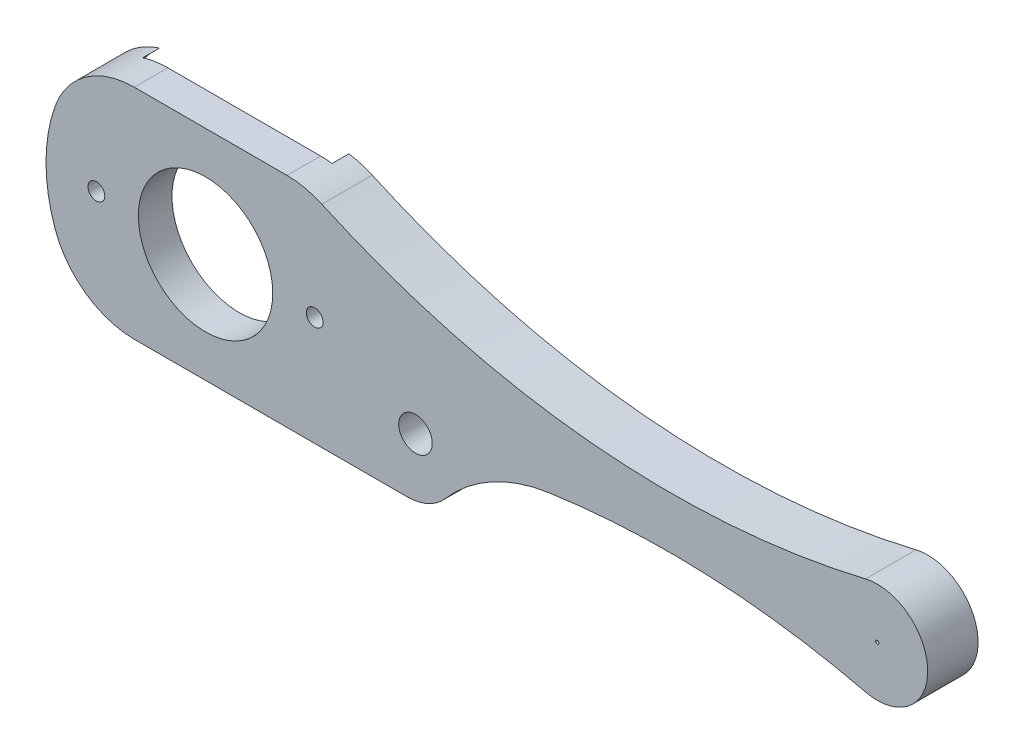
ISO-10303-21;
HEADER;
FILE_DESCRIPTION(('STEP AP214'),'2;1');
FILE_NAME('part.step','',(''),(''),'','','');
FILE_SCHEMA(('AUTOMOTIVE_DESIGN { 1 0 10303 214 1 1 1 1 }'));
ENDSEC;
DATA;
#1=APPLICATION_CONTEXT('core data for automotive mechanical design processes');
#2=APPLICATION_PROTOCOL_DEFINITION('international standard','automotive_design',2000,#1);
#3=PRODUCT_CONTEXT('',#1,'mechanical');
#4=PRODUCT('Part','Part','',(#3));
#5=PRODUCT_RELATED_PRODUCT_CATEGORY('part','',(#4));
#6=PRODUCT_DEFINITION_FORMATION('','',#4);
#7=PRODUCT_DEFINITION_CONTEXT('part definition',#1,'design');
#8=PRODUCT_DEFINITION('design','',#6,#7);
#9=PRODUCT_DEFINITION_SHAPE('','',#8);
#10=(LENGTH_UNIT() NAMED_UNIT(*) SI_UNIT(.MILLI.,.METRE.));
#11=(NAMED_UNIT(*) PLANE_ANGLE_UNIT() SI_UNIT($,.RADIAN.));
#12=(NAMED_UNIT(*) SI_UNIT($,.STERADIAN.) SOLID_ANGLE_UNIT());
#13=UNCERTAINTY_MEASURE_WITH_UNIT(LENGTH_MEASURE(1.E-05),#10,'distance_accuracy_value','');
#14=(GEOMETRIC_REPRESENTATION_CONTEXT(3) GLOBAL_UNCERTAINTY_ASSIGNED_CONTEXT((#13)) GLOBAL_UNIT_ASSIGNED_CONTEXT((#10,
#11,#12)) REPRESENTATION_CONTEXT('',''));
#15=CARTESIAN_POINT('',(0.,0.,0.));
#16=DIRECTION('',(0.,0.,1.));
#17=DIRECTION('',(1.,0.,0.));
#18=AXIS2_PLACEMENT_3D('',#15,#16,#17);
#19=CARTESIAN_POINT('',(-15.,-15.,0.));
#20=DIRECTION('',(0.,0.,1.));
#21=DIRECTION('',(1.,0.,0.));
#22=AXIS2_PLACEMENT_3D('',#19,#20,#21);
#23=PLANE('',#22);
#24=CARTESIAN_POINT('',(0.,0.,0.));
#25=DIRECTION('',(0.,0.,1.));
#26=DIRECTION('',(1.,0.,0.));
#27=AXIS2_PLACEMENT_3D('',#24,#25,#26);
#28=CIRCLE('',#27,9.5);
#29=CARTESIAN_POINT('',(-8.9566858950296,3.16666666666667,0.));
#30=VERTEX_POINT('',#29);
#31=CARTESIAN_POINT('',(-8.9566858950296,-3.16666666666667,0.));
#32=VERTEX_POINT('',#31);
#33=EDGE_CURVE('E337',#30,#32,#28,.T.);
#34=ORIENTED_EDGE('',*,*,#33,.F.);
#35=CARTESIAN_POINT('',(-4.24264068711928,1.5,0.));
#36=DIRECTION('',(0.,0.,1.));
#37=DIRECTION('',(1.,0.,0.));
#38=AXIS2_PLACEMENT_3D('',#35,#36,#37);
#39=CIRCLE('',#38,5.);
#40=CARTESIAN_POINT('',(-5.73773447853214,6.27123616632825,0.));
#41=VERTEX_POINT('',#40);
#42=EDGE_CURVE('E335',#41,#30,#39,.T.);
#43=ORIENTED_EDGE('',*,*,#42,.F.);
#44=CARTESIAN_POINT('',(0.,0.,0.));
#45=DIRECTION('',(0.,0.,1.));
#46=DIRECTION('',(1.,0.,0.));
#47=AXIS2_PLACEMENT_3D('',#44,#45,#46);
#48=CIRCLE('',#47,8.5);
#49=CARTESIAN_POINT('',(-5.73773447853214,-6.27123616632825,0.));
#50=VERTEX_POINT('',#49);
#51=EDGE_CURVE('E398',#41,#50,#48,.T.);
#52=ORIENTED_EDGE('',*,*,#51,.T.);
#53=CARTESIAN_POINT('',(-4.24264068711928,-1.5,0.));
#54=DIRECTION('',(0.,0.,1.));
#55=DIRECTION('',(-1.,0.,0.));
#56=AXIS2_PLACEMENT_3D('',#53,#54,#55);
#57=CIRCLE('',#56,5.);
#58=EDGE_CURVE('E340',#32,#50,#57,.T.);
#59=ORIENTED_EDGE('',*,*,#58,.F.);
#60=EDGE_LOOP('',(#34,#43,#52,#59));
#61=FACE_BOUND('',#60,.T.);
#62=ADVANCED_FACE('F34',(#61),#23,.F.);
#63=CARTESIAN_POINT('',(0.,0.,1.));
#64=DIRECTION('',(0.,0.,-1.));
#65=DIRECTION('',(-1.,0.,0.));
#66=AXIS2_PLACEMENT_3D('',#63,#64,#65);
#67=CYLINDRICAL_SURFACE('',#66,8.5);
#68=DIRECTION('',(0.,0.,-1.));
#69=VECTOR('',#68,1.);
#70=CARTESIAN_POINT('',(5.53211423569837,6.45334890449784,1.5));
#71=LINE('',#70,#69);
#72=CARTESIAN_POINT('',(5.53211423569837,6.45334890449784,0.));
#73=VERTEX_POINT('',#72);
#74=CARTESIAN_POINT('',(5.53211423569837,6.45334890449784,1.));
#75=VERTEX_POINT('',#74);
#76=EDGE_CURVE('E42',#73,#75,#71,.F.);
#77=ORIENTED_EDGE('',*,*,#76,.F.);
#78=CARTESIAN_POINT('',(5.47722557505166,-6.5,0.));
#79=VERTEX_POINT('',#78);
#80=EDGE_CURVE('E393',#79,#73,#48,.T.);
#81=ORIENTED_EDGE('',*,*,#80,.F.);
#82=DIRECTION('',(0.,0.,-1.));
#83=VECTOR('',#82,1.);
#84=CARTESIAN_POINT('',(5.47722557505166,-6.5,1.));
#85=LINE('',#84,#83);
#86=CARTESIAN_POINT('',(5.47722557505166,-6.5,1.));
#87=VERTEX_POINT('',#86);
#88=EDGE_CURVE('E429',#87,#79,#85,.T.);
#89=ORIENTED_EDGE('',*,*,#88,.F.);
#90=CARTESIAN_POINT('',(0.,0.,1.));
#91=DIRECTION('',(0.,0.,1.));
#92=DIRECTION('',(1.,0.,0.));
#93=AXIS2_PLACEMENT_3D('',#90,#91,#92);
#94=CIRCLE('',#93,8.5);
#95=EDGE_CURVE('E394',#87,#75,#94,.T.);
#96=ORIENTED_EDGE('',*,*,#95,.T.);
#97=EDGE_LOOP('',(#77,#81,#89,#96));
#98=FACE_BOUND('',#97,.T.);
#99=ADVANCED_FACE('F447',(#98),#67,.F.);
#100=CARTESIAN_POINT('',(15.3842180039987,-2.55797359602946,0.));
#101=DIRECTION('',(0.,0.,1.));
#102=DIRECTION('',(1.,0.,0.));
#103=AXIS2_PLACEMENT_3D('',#100,#101,#102);
#104=CIRCLE('',#103,0.625000000000002);
#105=CARTESIAN_POINT('',(14.7664310881251,-2.6526537236984,0.));
#106=VERTEX_POINT('',#105);
#107=CARTESIAN_POINT('',(15.7386882696293,-3.07273162732552,0.));
#108=VERTEX_POINT('',#107);
#109=EDGE_CURVE('E224',#106,#108,#104,.T.);
#110=ORIENTED_EDGE('',*,*,#109,.T.);
#111=CARTESIAN_POINT('',(21.8639344597254,-11.9677504081215,0.));
#112=DIRECTION('',(0.,0.,1.));
#113=DIRECTION('',(1.,0.,0.));
#114=AXIS2_PLACEMENT_3D('',#111,#112,#113);
#115=CIRCLE('',#114,10.8);
#116=CARTESIAN_POINT('',(20.2974780138513,-1.28195543520632,0.));
#117=VERTEX_POINT('',#116);
#118=EDGE_CURVE('E49',#117,#108,#115,.T.);
#119=ORIENTED_EDGE('',*,*,#118,.F.);
#120=CARTESIAN_POINT('',(27.665625,-51.5447688263259,0.));
#121=DIRECTION('',(0.,0.,1.));
#122=DIRECTION('',(1.,0.,0.));
#123=AXIS2_PLACEMENT_3D('',#120,#121,#122);
#124=CIRCLE('',#123,50.8);
#125=CARTESIAN_POINT('',(36.3766297245662,-1.49720748025643,0.));
#126=VERTEX_POINT('',#125);
#127=EDGE_CURVE('E214',#126,#117,#124,.T.);
#128=ORIENTED_EDGE('',*,*,#127,.F.);
#129=CARTESIAN_POINT('',(36.4838025189137,-0.881464845585303,0.));
#130=DIRECTION('',(0.,0.,1.));
#131=DIRECTION('',(1.,0.,0.));
#132=AXIS2_PLACEMENT_3D('',#129,#130,#131);
#133=CIRCLE('',#132,0.624999999999998);
#134=CARTESIAN_POINT('',(37.0900434639286,-0.729488148070595,0.));
#135=VERTEX_POINT('',#134);
#136=EDGE_CURVE('E254',#126,#135,#133,.T.);
#137=ORIENTED_EDGE('',*,*,#136,.T.);
#138=CARTESIAN_POINT('',(40.,0.,0.));
#139=DIRECTION('',(0.,0.,1.));
#140=DIRECTION('',(1.,0.,0.));
#141=AXIS2_PLACEMENT_3D('',#138,#139,#140);
#142=CIRCLE('',#141,3.00000000000001);
#143=CARTESIAN_POINT('',(37.0900434639286,0.729488148070596,0.));
#144=VERTEX_POINT('',#143);
#145=EDGE_CURVE('E257',#144,#135,#142,.T.);
#146=ORIENTED_EDGE('',*,*,#145,.F.);
#147=CARTESIAN_POINT('',(36.4838025189137,0.881464845585303,0.));
#148=DIRECTION('',(0.,0.,1.));
#149=DIRECTION('',(1.,0.,0.));
#150=AXIS2_PLACEMENT_3D('',#147,#148,#149);
#151=CIRCLE('',#150,0.624999999999998);
#152=CARTESIAN_POINT('',(36.3766297245662,1.49720748025643,0.));
#153=VERTEX_POINT('',#152);
#154=EDGE_CURVE('E260',#144,#153,#151,.T.);
#155=ORIENTED_EDGE('',*,*,#154,.T.);
#156=CARTESIAN_POINT('',(27.665625,51.5447688263259,0.));
#157=DIRECTION('',(0.,0.,1.));
#158=DIRECTION('',(1.,0.,0.));
#159=AXIS2_PLACEMENT_3D('',#156,#157,#158);
#160=CIRCLE('',#159,50.8);
#161=CARTESIAN_POINT('',(10.0492827611848,3.89705653995334,0.));
#162=VERTEX_POINT('',#161);
#163=EDGE_CURVE('E263',#162,#153,#160,.T.);
#164=ORIENTED_EDGE('',*,*,#163,.F.);
#165=CARTESIAN_POINT('',(9.83254626710492,3.3108396072962,0.));
#166=DIRECTION('',(0.,0.,1.));
#167=DIRECTION('',(1.,0.,0.));
#168=AXIS2_PLACEMENT_3D('',#165,#166,#167);
#169=CIRCLE('',#168,0.625);
#170=CARTESIAN_POINT('',(9.24022420282149,3.11139143818197,0.));
#171=VERTEX_POINT('',#170);
#172=EDGE_CURVE('E266',#162,#171,#169,.T.);
#173=ORIENTED_EDGE('',*,*,#172,.T.);
#174=CARTESIAN_POINT('',(0.,0.,0.));
#175=DIRECTION('',(0.,0.,1.));
#176=DIRECTION('',(1.,0.,0.));
#177=AXIS2_PLACEMENT_3D('',#174,#175,#176);
#178=CIRCLE('',#177,9.75);
#179=CARTESIAN_POINT('',(9.69901256334507,-0.995818907269018,0.));
#180=VERTEX_POINT('',#179);
#181=EDGE_CURVE('E269',#180,#171,#178,.T.);
#182=ORIENTED_EDGE('',*,*,#181,.F.);
#183=CARTESIAN_POINT('',(10.3207441379185,-1.05965345260677,0.));
#184=DIRECTION('',(0.,0.,1.));
#185=DIRECTION('',(1.,0.,0.));
#186=AXIS2_PLACEMENT_3D('',#183,#184,#185);
#187=CIRCLE('',#186,0.625);
#188=CARTESIAN_POINT('',(10.7875312379464,-1.4752672195197,0.));
#189=VERTEX_POINT('',#188);
#190=EDGE_CURVE('E272',#180,#189,#187,.T.);
#191=ORIENTED_EDGE('',*,*,#190,.T.);
#192=CARTESIAN_POINT('',(12.5,-3.,0.));
#193=DIRECTION('',(0.,0.,1.));
#194=DIRECTION('',(1.,0.,0.));
#195=AXIS2_PLACEMENT_3D('',#192,#193,#194);
#196=CIRCLE('',#195,2.29289321881345);
#197=EDGE_CURVE('E275',#106,#189,#196,.T.);
#198=ORIENTED_EDGE('',*,*,#197,.F.);
#199=EDGE_LOOP('',(#110,#119,#128,#137,#146,#155,#164,#173,#182,#191,#198));
#200=FACE_BOUND('',#199,.T.);
#201=ORIENTED_EDGE('',*,*,#80,.T.);
#202=CARTESIAN_POINT('',(4.85069319822591,1.5,0.));
#203=DIRECTION('',(0.,0.,1.));
#204=DIRECTION('',(1.,0.,0.));
#205=AXIS2_PLACEMENT_3D('',#202,#203,#204);
#206=CIRCLE('',#205,5.);
#207=CARTESIAN_POINT('',(6.9247779074781,6.0495244387569,0.));
#208=VERTEX_POINT('',#207);
#209=EDGE_CURVE('E333',#208,#73,#206,.T.);
#210=ORIENTED_EDGE('',*,*,#209,.F.);
#211=CARTESIAN_POINT('',(27.665625,51.5447688263259,0.));
#212=DIRECTION('',(0.,0.,-1.));
#213=DIRECTION('',(1.,0.,0.));
#214=AXIS2_PLACEMENT_3D('',#211,#212,#213);
#215=CIRCLE('',#214,50.);
#216=CARTESIAN_POINT('',(39.3018278301887,2.91762842413166,0.));
#217=VERTEX_POINT('',#216);
#218=EDGE_CURVE('E215',#217,#208,#215,.T.);
#219=ORIENTED_EDGE('',*,*,#218,.F.);
#220=CARTESIAN_POINT('',(40.,0.,0.));
#221=DIRECTION('',(0.,0.,1.));
#222=DIRECTION('',(1.,0.,0.));
#223=AXIS2_PLACEMENT_3D('',#220,#221,#222);
#224=CIRCLE('',#223,3.00000000000001);
#225=CARTESIAN_POINT('',(39.3018278301887,-2.91762842413166,0.));
#226=VERTEX_POINT('',#225);
#227=EDGE_CURVE('E300',#226,#217,#224,.T.);
#228=ORIENTED_EDGE('',*,*,#227,.F.);
#229=CARTESIAN_POINT('',(27.665625,-51.5447688263259,0.));
#230=DIRECTION('',(0.,0.,-1.));
#231=DIRECTION('',(-1.,0.,0.));
#232=AXIS2_PLACEMENT_3D('',#229,#230,#231);
#233=CIRCLE('',#232,50.);
#234=CARTESIAN_POINT('',(20.4135118246568,-2.0734958035704,0.));
#235=VERTEX_POINT('',#234);
#236=EDGE_CURVE('E350',#235,#226,#233,.T.);
#237=ORIENTED_EDGE('',*,*,#236,.F.);
#238=CARTESIAN_POINT('',(21.8639344597254,-11.9677504081215,0.));
#239=DIRECTION('',(0.,0.,-1.));
#240=DIRECTION('',(-1.,0.,0.));
#241=AXIS2_PLACEMENT_3D('',#238,#239,#240);
#242=CIRCLE('',#241,10.);
#243=CARTESIAN_POINT('',(14.2762925676289,-5.45409624802804,0.));
#244=VERTEX_POINT('',#243);
#245=EDGE_CURVE('E347',#244,#235,#242,.T.);
#246=ORIENTED_EDGE('',*,*,#245,.F.);
#247=CARTESIAN_POINT('',(12.,-3.5,0.));
#248=DIRECTION('',(0.,0.,1.));
#249=DIRECTION('',(1.,0.,0.));
#250=AXIS2_PLACEMENT_3D('',#247,#248,#249);
#251=CIRCLE('',#250,3.);
#252=CARTESIAN_POINT('',(12.,-6.5,0.));
#253=VERTEX_POINT('',#252);
#254=EDGE_CURVE('E344',#253,#244,#251,.T.);
#255=ORIENTED_EDGE('',*,*,#254,.F.);
#256=DIRECTION('',(1.,0.,0.));
#257=VECTOR('',#256,1.);
#258=CARTESIAN_POINT('',(-4.24264068711928,-6.5,0.));
#259=LINE('',#258,#257);
#260=EDGE_CURVE('E342',#79,#253,#259,.T.);
#261=ORIENTED_EDGE('',*,*,#260,.F.);
#262=EDGE_LOOP('',(#201,#210,#219,#228,#237,#246,#255,#261));
#263=FACE_BOUND('',#262,.T.);
#264=CARTESIAN_POINT('',(40.,0.,0.));
#265=DIRECTION('',(0.,0.,1.));
#266=DIRECTION('',(1.,0.,0.));
#267=AXIS2_PLACEMENT_3D('',#264,#265,#266);
#268=CIRCLE('',#267,0.100000000000001);
#269=CARTESIAN_POINT('',(40.1,0.,0.));
#270=VERTEX_POINT('',#269);
#271=EDGE_CURVE('E420',#270,#270,#268,.T.);
#272=ORIENTED_EDGE('',*,*,#271,.T.);
#273=EDGE_LOOP('',(#272));
#274=FACE_BOUND('',#273,.T.);
#275=CARTESIAN_POINT('',(12.5,-3.,0.));
#276=DIRECTION('',(0.,0.,-1.));
#277=DIRECTION('',(-1.,0.,0.));
#278=AXIS2_PLACEMENT_3D('',#275,#276,#277);
#279=CIRCLE('',#278,0.999999999999999);
#280=CARTESIAN_POINT('',(11.5,-3.,0.));
#281=VERTEX_POINT('',#280);
#282=EDGE_CURVE('E411',#281,#281,#279,.T.);
#283=ORIENTED_EDGE('',*,*,#282,.F.);
#284=EDGE_LOOP('',(#283));
#285=FACE_BOUND('',#284,.T.);
#286=ADVANCED_FACE('F36',(#200,#263,#274,#285),#23,.F.);
#287=CARTESIAN_POINT('',(-15.,-15.,3.));
#288=DIRECTION('',(0.,0.,1.));
#289=DIRECTION('',(1.,0.,0.));
#290=AXIS2_PLACEMENT_3D('',#287,#288,#289);
#291=PLANE('',#290);
#292=CARTESIAN_POINT('',(27.665625,51.5447688263259,3.));
#293=DIRECTION('',(0.,0.,-1.));
#294=DIRECTION('',(1.,0.,0.));
#295=AXIS2_PLACEMENT_3D('',#292,#293,#294);
#296=CIRCLE('',#295,50.);
#297=CARTESIAN_POINT('',(39.3018278301887,2.91762842413166,3.));
#298=VERTEX_POINT('',#297);
#299=CARTESIAN_POINT('',(6.9247779074781,6.0495244387569,3.));
#300=VERTEX_POINT('',#299);
#301=EDGE_CURVE('E57',#298,#300,#296,.T.);
#302=ORIENTED_EDGE('',*,*,#301,.T.);
#303=CARTESIAN_POINT('',(4.85069319822591,1.5,3.));
#304=DIRECTION('',(0.,0.,1.));
#305=DIRECTION('',(1.,0.,0.));
#306=AXIS2_PLACEMENT_3D('',#303,#304,#305);
#307=CIRCLE('',#306,5.);
#308=CARTESIAN_POINT('',(4.85069319822591,6.5,3.));
#309=VERTEX_POINT('',#308);
#310=EDGE_CURVE('E299',#300,#309,#307,.T.);
#311=ORIENTED_EDGE('',*,*,#310,.T.);
#312=DIRECTION('',(-1.,0.,0.));
#313=VECTOR('',#312,1.);
#314=CARTESIAN_POINT('',(-4.24264068711928,6.5,3.));
#315=LINE('',#314,#313);
#316=CARTESIAN_POINT('',(-4.24264068711928,6.5,3.));
#317=VERTEX_POINT('',#316);
#318=EDGE_CURVE('E303',#309,#317,#315,.T.);
#319=ORIENTED_EDGE('',*,*,#318,.T.);
#320=CARTESIAN_POINT('',(-4.24264068711928,1.5,3.));
#321=DIRECTION('',(0.,0.,1.));
#322=DIRECTION('',(1.,0.,0.));
#323=AXIS2_PLACEMENT_3D('',#320,#321,#322);
#324=CIRCLE('',#323,5.);
#325=CARTESIAN_POINT('',(-8.9566858950296,3.16666666666667,3.));
#326=VERTEX_POINT('',#325);
#327=EDGE_CURVE('E306',#317,#326,#324,.T.);
#328=ORIENTED_EDGE('',*,*,#327,.T.);
#329=CARTESIAN_POINT('',(0.,0.,3.));
#330=DIRECTION('',(0.,0.,1.));
#331=DIRECTION('',(1.,0.,0.));
#332=AXIS2_PLACEMENT_3D('',#329,#330,#331);
#333=CIRCLE('',#332,9.5);
#334=CARTESIAN_POINT('',(-8.9566858950296,-3.16666666666667,3.));
#335=VERTEX_POINT('',#334);
#336=EDGE_CURVE('E309',#326,#335,#333,.T.);
#337=ORIENTED_EDGE('',*,*,#336,.T.);
#338=CARTESIAN_POINT('',(-4.24264068711928,-1.5,3.));
#339=DIRECTION('',(0.,0.,1.));
#340=DIRECTION('',(-1.,0.,0.));
#341=AXIS2_PLACEMENT_3D('',#338,#339,#340);
#342=CIRCLE('',#341,5.);
#343=CARTESIAN_POINT('',(-4.24264068711928,-6.5,3.));
#344=VERTEX_POINT('',#343);
#345=EDGE_CURVE('E312',#335,#344,#342,.T.);
#346=ORIENTED_EDGE('',*,*,#345,.T.);
#347=DIRECTION('',(1.,0.,0.));
#348=VECTOR('',#347,1.);
#349=CARTESIAN_POINT('',(-4.24264068711928,-6.5,3.));
#350=LINE('',#349,#348);
#351=CARTESIAN_POINT('',(12.,-6.5,3.));
#352=VERTEX_POINT('',#351);
#353=EDGE_CURVE('E315',#344,#352,#350,.T.);
#354=ORIENTED_EDGE('',*,*,#353,.T.);
#355=CARTESIAN_POINT('',(12.,-3.5,3.));
#356=DIRECTION('',(0.,0.,1.));
#357=DIRECTION('',(1.,0.,0.));
#358=AXIS2_PLACEMENT_3D('',#355,#356,#357);
#359=CIRCLE('',#358,3.);
#360=CARTESIAN_POINT('',(14.2762925676289,-5.45409624802804,3.));
#361=VERTEX_POINT('',#360);
#362=EDGE_CURVE('E318',#352,#361,#359,.T.);
#363=ORIENTED_EDGE('',*,*,#362,.T.);
#364=CARTESIAN_POINT('',(21.8639344597254,-11.9677504081215,3.));
#365=DIRECTION('',(0.,0.,-1.));
#366=DIRECTION('',(-1.,0.,0.));
#367=AXIS2_PLACEMENT_3D('',#364,#365,#366);
#368=CIRCLE('',#367,10.);
#369=CARTESIAN_POINT('',(20.4135118246568,-2.0734958035704,3.));
#370=VERTEX_POINT('',#369);
#371=EDGE_CURVE('E321',#361,#370,#368,.T.);
#372=ORIENTED_EDGE('',*,*,#371,.T.);
#373=CARTESIAN_POINT('',(27.665625,-51.5447688263259,3.));
#374=DIRECTION('',(0.,0.,-1.));
#375=DIRECTION('',(-1.,0.,0.));
#376=AXIS2_PLACEMENT_3D('',#373,#374,#375);
#377=CIRCLE('',#376,50.);
#378=CARTESIAN_POINT('',(39.3018278301887,-2.91762842413166,3.));
#379=VERTEX_POINT('',#378);
#380=EDGE_CURVE('E324',#370,#379,#377,.T.);
#381=ORIENTED_EDGE('',*,*,#380,.T.);
#382=CARTESIAN_POINT('',(40.,0.,3.));
#383=DIRECTION('',(0.,0.,1.));
#384=DIRECTION('',(1.,0.,0.));
#385=AXIS2_PLACEMENT_3D('',#382,#383,#384);
#386=CIRCLE('',#385,3.00000000000001);
#387=EDGE_CURVE('E327',#379,#298,#386,.T.);
#388=ORIENTED_EDGE('',*,*,#387,.T.);
#389=EDGE_LOOP('',(#302,#311,#319,#328,#337,#346,#354,#363,#372,#381,#388));
#390=FACE_BOUND('',#389,.T.);
#391=CARTESIAN_POINT('',(12.5,-3.,3.));
#392=DIRECTION('',(0.,0.,-1.));
#393=DIRECTION('',(-1.,0.,0.));
#394=AXIS2_PLACEMENT_3D('',#391,#392,#393);
#395=CIRCLE('',#394,0.999999999999999);
#396=CARTESIAN_POINT('',(11.5,-3.,3.));
#397=VERTEX_POINT('',#396);
#398=EDGE_CURVE('E408',#397,#397,#395,.T.);
#399=ORIENTED_EDGE('',*,*,#398,.T.);
#400=EDGE_LOOP('',(#399));
#401=FACE_BOUND('',#400,.T.);
#402=CARTESIAN_POINT('',(-6.5,0.,3.));
#403=DIRECTION('',(0.,0.,-1.));
#404=DIRECTION('',(-1.,0.,0.));
#405=AXIS2_PLACEMENT_3D('',#402,#403,#404);
#406=CIRCLE('',#405,0.499999999999999);
#407=CARTESIAN_POINT('',(-7.,0.,3.));
#408=VERTEX_POINT('',#407);
#409=EDGE_CURVE('E414',#408,#408,#406,.T.);
#410=ORIENTED_EDGE('',*,*,#409,.T.);
#411=EDGE_LOOP('',(#410));
#412=FACE_BOUND('',#411,.T.);
#413=CARTESIAN_POINT('',(6.5,0.,3.));
#414=DIRECTION('',(0.,0.,-1.));
#415=DIRECTION('',(-1.,0.,0.));
#416=AXIS2_PLACEMENT_3D('',#413,#414,#415);
#417=CIRCLE('',#416,0.499999999999999);
#418=CARTESIAN_POINT('',(6.,0.,3.));
#419=VERTEX_POINT('',#418);
#420=EDGE_CURVE('E417',#419,#419,#417,.T.);
#421=ORIENTED_EDGE('',*,*,#420,.T.);
#422=EDGE_LOOP('',(#421));
#423=FACE_BOUND('',#422,.T.);
#424=CARTESIAN_POINT('',(0.,0.,3.));
#425=DIRECTION('',(0.,0.,1.));
#426=DIRECTION('',(1.,0.,0.));
#427=AXIS2_PLACEMENT_3D('',#424,#425,#426);
#428=CIRCLE('',#427,4.);
#429=CARTESIAN_POINT('',(4.,0.,3.));
#430=VERTEX_POINT('',#429);
#431=EDGE_CURVE('E424',#430,#430,#428,.T.);
#432=ORIENTED_EDGE('',*,*,#431,.F.);
#433=EDGE_LOOP('',(#432));
#434=FACE_BOUND('',#433,.T.);
#435=CARTESIAN_POINT('',(40.,0.,3.));
#436=DIRECTION('',(0.,0.,1.));
#437=DIRECTION('',(1.,0.,0.));
#438=AXIS2_PLACEMENT_3D('',#435,#436,#437);
#439=CIRCLE('',#438,0.100000000000001);
#440=CARTESIAN_POINT('',(40.1,0.,3.));
#441=VERTEX_POINT('',#440);
#442=EDGE_CURVE('E421',#441,#441,#439,.T.);
#443=ORIENTED_EDGE('',*,*,#442,.F.);
#444=EDGE_LOOP('',(#443));
#445=FACE_BOUND('',#444,.T.);
#446=ADVANCED_FACE('F463',(#390,#401,#412,#423,#434,#445),#291,.T.);
#447=CARTESIAN_POINT('',(0.,0.,3.));
#448=DIRECTION('',(0.,0.,-1.));
#449=DIRECTION('',(-1.,0.,0.));
#450=AXIS2_PLACEMENT_3D('',#447,#448,#449);
#451=CYLINDRICAL_SURFACE('',#450,4.);
#452=CARTESIAN_POINT('',(0.,0.,1.));
#453=DIRECTION('',(0.,0.,1.));
#454=DIRECTION('',(1.,0.,0.));
#455=AXIS2_PLACEMENT_3D('',#452,#453,#454);
#456=CIRCLE('',#455,4.);
#457=CARTESIAN_POINT('',(4.,0.,1.));
#458=VERTEX_POINT('',#457);
#459=EDGE_CURVE('E404',#458,#458,#456,.T.);
#460=ORIENTED_EDGE('',*,*,#459,.F.);
#461=EDGE_LOOP('',(#460));
#462=FACE_BOUND('',#461,.T.);
#463=ORIENTED_EDGE('',*,*,#431,.T.);
#464=EDGE_LOOP('',(#463));
#465=FACE_BOUND('',#464,.T.);
#466=ADVANCED_FACE('F518',(#462,#465),#451,.F.);
#467=CARTESIAN_POINT('',(40.,0.,3.));
#468=DIRECTION('',(0.,0.,-1.));
#469=DIRECTION('',(-1.,0.,0.));
#470=AXIS2_PLACEMENT_3D('',#467,#468,#469);
#471=CYLINDRICAL_SURFACE('',#470,0.100000000000001);
#472=ORIENTED_EDGE('',*,*,#442,.T.);
#473=EDGE_LOOP('',(#472));
#474=FACE_BOUND('',#473,.T.);
#475=ORIENTED_EDGE('',*,*,#271,.F.);
#476=EDGE_LOOP('',(#475));
#477=FACE_BOUND('',#476,.T.);
#478=ADVANCED_FACE('F780',(#474,#477),#471,.F.);
#479=CARTESIAN_POINT('',(6.5,0.,0.));
#480=DIRECTION('',(0.,0.,-1.));
#481=DIRECTION('',(-1.,0.,0.));
#482=AXIS2_PLACEMENT_3D('',#479,#480,#481);
#483=CYLINDRICAL_SURFACE('',#482,0.499999999999999);
#484=CARTESIAN_POINT('',(6.5,0.,1.));
#485=DIRECTION('',(0.,0.,1.));
#486=DIRECTION('',(1.,0.,0.));
#487=AXIS2_PLACEMENT_3D('',#484,#485,#486);
#488=CIRCLE('',#487,0.499999999999999);
#489=CARTESIAN_POINT('',(7.,0.,1.));
#490=VERTEX_POINT('',#489);
#491=EDGE_CURVE('E401',#490,#490,#488,.F.);
#492=ORIENTED_EDGE('',*,*,#491,.T.);
#493=EDGE_LOOP('',(#492));
#494=FACE_BOUND('',#493,.T.);
#495=ORIENTED_EDGE('',*,*,#420,.F.);
#496=EDGE_LOOP('',(#495));
#497=FACE_BOUND('',#496,.T.);
#498=ADVANCED_FACE('F771',(#494,#497),#483,.F.);
#499=CARTESIAN_POINT('',(-6.5,0.,0.));
#500=DIRECTION('',(0.,0.,-1.));
#501=DIRECTION('',(-1.,0.,0.));
#502=AXIS2_PLACEMENT_3D('',#499,#500,#501);
#503=CYLINDRICAL_SURFACE('',#502,0.499999999999999);
#504=CARTESIAN_POINT('',(-6.5,0.,1.));
#505=DIRECTION('',(0.,0.,1.));
#506=DIRECTION('',(1.,0.,0.));
#507=AXIS2_PLACEMENT_3D('',#504,#505,#506);
#508=CIRCLE('',#507,0.499999999999999);
#509=CARTESIAN_POINT('',(-6.,0.,1.));
#510=VERTEX_POINT('',#509);
#511=EDGE_CURVE('E405',#510,#510,#508,.F.);
#512=ORIENTED_EDGE('',*,*,#511,.T.);
#513=EDGE_LOOP('',(#512));
#514=FACE_BOUND('',#513,.T.);
#515=ORIENTED_EDGE('',*,*,#409,.F.);
#516=EDGE_LOOP('',(#515));
#517=FACE_BOUND('',#516,.T.);
#518=ADVANCED_FACE('F761',(#514,#517),#503,.F.);
#519=CARTESIAN_POINT('',(12.5,-3.,0.));
#520=DIRECTION('',(0.,0.,-1.));
#521=DIRECTION('',(-1.,0.,0.));
#522=AXIS2_PLACEMENT_3D('',#519,#520,#521);
#523=CYLINDRICAL_SURFACE('',#522,0.999999999999999);
#524=ORIENTED_EDGE('',*,*,#398,.F.);
#525=EDGE_LOOP('',(#524));
#526=FACE_BOUND('',#525,.T.);
#527=ORIENTED_EDGE('',*,*,#282,.T.);
#528=EDGE_LOOP('',(#527));
#529=FACE_BOUND('',#528,.T.);
#530=ADVANCED_FACE('F748',(#526,#529),#523,.F.);
#531=CARTESIAN_POINT('',(0.,0.,1.));
#532=DIRECTION('',(0.,0.,1.));
#533=DIRECTION('',(1.,0.,0.));
#534=AXIS2_PLACEMENT_3D('',#531,#532,#533);
#535=PLANE('',#534);
#536=ORIENTED_EDGE('',*,*,#459,.T.);
#537=EDGE_LOOP('',(#536));
#538=FACE_BOUND('',#537,.T.);
#539=ORIENTED_EDGE('',*,*,#511,.F.);
#540=EDGE_LOOP('',(#539));
#541=FACE_BOUND('',#540,.T.);
#542=DIRECTION('',(1.,0.,0.));
#543=VECTOR('',#542,1.);
#544=CARTESIAN_POINT('',(0.,6.5,1.));
#545=LINE('',#544,#543);
#546=CARTESIAN_POINT('',(-4.24264068711928,6.5,1.));
#547=VERTEX_POINT('',#546);
#548=CARTESIAN_POINT('',(4.85069319822591,6.5,1.));
#549=VERTEX_POINT('',#548);
#550=EDGE_CURVE('E12',#547,#549,#545,.T.);
#551=ORIENTED_EDGE('',*,*,#550,.T.);
#552=CARTESIAN_POINT('',(4.85069319822591,1.5,1.));
#553=DIRECTION('',(0.,0.,1.));
#554=DIRECTION('',(1.,0.,0.));
#555=AXIS2_PLACEMENT_3D('',#552,#553,#554);
#556=CIRCLE('',#555,5.);
#557=EDGE_CURVE('E390',#549,#75,#556,.F.);
#558=ORIENTED_EDGE('',*,*,#557,.T.);
#559=ORIENTED_EDGE('',*,*,#95,.F.);
#560=DIRECTION('',(-1.,0.,0.));
#561=VECTOR('',#560,1.);
#562=CARTESIAN_POINT('',(0.,-6.5,1.));
#563=LINE('',#562,#561);
#564=CARTESIAN_POINT('',(-4.24264068711928,-6.5,1.));
#565=VERTEX_POINT('',#564);
#566=EDGE_CURVE('E381',#87,#565,#563,.T.);
#567=ORIENTED_EDGE('',*,*,#566,.T.);
#568=CARTESIAN_POINT('',(-4.24264068711928,-1.5,1.));
#569=DIRECTION('',(0.,0.,1.));
#570=DIRECTION('',(1.,0.,0.));
#571=AXIS2_PLACEMENT_3D('',#568,#569,#570);
#572=CIRCLE('',#571,5.);
#573=CARTESIAN_POINT('',(-5.73773447853214,-6.27123616632826,1.));
#574=VERTEX_POINT('',#573);
#575=EDGE_CURVE('E384',#565,#574,#572,.F.);
#576=ORIENTED_EDGE('',*,*,#575,.T.);
#577=CARTESIAN_POINT('',(-5.73773447853214,6.27123616632825,1.));
#578=VERTEX_POINT('',#577);
#579=EDGE_CURVE('E397',#578,#574,#94,.T.);
#580=ORIENTED_EDGE('',*,*,#579,.F.);
#581=CARTESIAN_POINT('',(-4.24264068711928,1.5,1.));
#582=DIRECTION('',(0.,0.,1.));
#583=DIRECTION('',(1.,0.,0.));
#584=AXIS2_PLACEMENT_3D('',#581,#582,#583);
#585=CIRCLE('',#584,5.);
#586=EDGE_CURVE('E387',#578,#547,#585,.F.);
#587=ORIENTED_EDGE('',*,*,#586,.T.);
#588=EDGE_LOOP('',(#551,#558,#559,#567,#576,#580,#587));
#589=FACE_BOUND('',#588,.T.);
#590=ORIENTED_EDGE('',*,*,#491,.F.);
#591=EDGE_LOOP('',(#590));
#592=FACE_BOUND('',#591,.T.);
#593=ADVANCED_FACE('F444',(#538,#541,#589,#592),#535,.F.);
#594=DIRECTION('',(0.,0.,-1.));
#595=VECTOR('',#594,1.);
#596=CARTESIAN_POINT('',(-5.73773447853215,6.27123616632825,1.5));
#597=LINE('',#596,#595);
#598=EDGE_CURVE('E435',#578,#41,#597,.T.);
#599=ORIENTED_EDGE('',*,*,#598,.F.);
#600=ORIENTED_EDGE('',*,*,#579,.T.);
#601=DIRECTION('',(0.,0.,-1.));
#602=VECTOR('',#601,1.);
#603=CARTESIAN_POINT('',(-5.73773447853215,-6.27123616632825,1.5));
#604=LINE('',#603,#602);
#605=EDGE_CURVE('E433',#50,#574,#604,.F.);
#606=ORIENTED_EDGE('',*,*,#605,.F.);
#607=ORIENTED_EDGE('',*,*,#51,.F.);
#608=EDGE_LOOP('',(#599,#600,#606,#607));
#609=FACE_BOUND('',#608,.T.);
#610=ADVANCED_FACE('F473',(#609),#67,.F.);
#611=CARTESIAN_POINT('',(-4.24264068711928,6.5,3.));
#612=DIRECTION('',(0.,-1.,0.));
#613=DIRECTION('',(1.,0.,0.));
#614=AXIS2_PLACEMENT_3D('',#611,#612,#613);
#615=PLANE('',#614);
#616=DIRECTION('',(0.,0.,-1.));
#617=VECTOR('',#616,1.);
#618=CARTESIAN_POINT('',(-4.24264068711928,6.5,3.));
#619=LINE('',#618,#617);
#620=EDGE_CURVE('E373',#317,#547,#619,.T.);
#621=ORIENTED_EDGE('',*,*,#620,.F.);
#622=ORIENTED_EDGE('',*,*,#318,.F.);
#623=DIRECTION('',(0.,0.,-1.));
#624=VECTOR('',#623,1.);
#625=CARTESIAN_POINT('',(4.85069319822591,6.5,3.));
#626=LINE('',#625,#624);
#627=EDGE_CURVE('E376',#309,#549,#626,.T.);
#628=ORIENTED_EDGE('',*,*,#627,.T.);
#629=ORIENTED_EDGE('',*,*,#550,.F.);
#630=EDGE_LOOP('',(#621,#622,#628,#629));
#631=FACE_BOUND('',#630,.T.);
#632=ADVANCED_FACE('F488',(#631),#615,.F.);
#633=CARTESIAN_POINT('',(4.85069319822591,1.5,3.));
#634=DIRECTION('',(0.,0.,-1.));
#635=DIRECTION('',(-1.,0.,0.));
#636=AXIS2_PLACEMENT_3D('',#633,#634,#635);
#637=CYLINDRICAL_SURFACE('',#636,5.);
#638=ORIENTED_EDGE('',*,*,#627,.F.);
#639=ORIENTED_EDGE('',*,*,#310,.F.);
#640=DIRECTION('',(0.,0.,-1.));
#641=VECTOR('',#640,1.);
#642=CARTESIAN_POINT('',(6.9247779074781,6.0495244387569,3.));
#643=LINE('',#642,#641);
#644=EDGE_CURVE('E379',#300,#208,#643,.T.);
#645=ORIENTED_EDGE('',*,*,#644,.T.);
#646=ORIENTED_EDGE('',*,*,#209,.T.);
#647=ORIENTED_EDGE('',*,*,#76,.T.);
#648=ORIENTED_EDGE('',*,*,#557,.F.);
#649=EDGE_LOOP('',(#638,#639,#645,#646,#647,#648));
#650=FACE_BOUND('',#649,.T.);
#651=ADVANCED_FACE('F438',(#650),#637,.T.);
#652=CARTESIAN_POINT('',(-4.24264068711928,1.5,3.));
#653=DIRECTION('',(0.,0.,-1.));
#654=DIRECTION('',(-1.,0.,0.));
#655=AXIS2_PLACEMENT_3D('',#652,#653,#654);
#656=CYLINDRICAL_SURFACE('',#655,5.);
#657=ORIENTED_EDGE('',*,*,#598,.T.);
#658=ORIENTED_EDGE('',*,*,#42,.T.);
#659=DIRECTION('',(0.,0.,-1.));
#660=VECTOR('',#659,1.);
#661=CARTESIAN_POINT('',(-8.9566858950296,3.16666666666667,3.));
#662=LINE('',#661,#660);
#663=EDGE_CURVE('E370',#326,#30,#662,.T.);
#664=ORIENTED_EDGE('',*,*,#663,.F.);
#665=ORIENTED_EDGE('',*,*,#327,.F.);
#666=ORIENTED_EDGE('',*,*,#620,.T.);
#667=ORIENTED_EDGE('',*,*,#586,.F.);
#668=EDGE_LOOP('',(#657,#658,#664,#665,#666,#667));
#669=FACE_BOUND('',#668,.T.);
#670=ADVANCED_FACE('F478',(#669),#656,.T.);
#671=CARTESIAN_POINT('',(-4.24264068711928,-1.5,3.));
#672=DIRECTION('',(0.,0.,-1.));
#673=DIRECTION('',(-1.,0.,0.));
#674=AXIS2_PLACEMENT_3D('',#671,#672,#673);
#675=CYLINDRICAL_SURFACE('',#674,5.);
#676=DIRECTION('',(0.,0.,-1.));
#677=VECTOR('',#676,1.);
#678=CARTESIAN_POINT('',(-4.24264068711928,-6.5,3.));
#679=LINE('',#678,#677);
#680=EDGE_CURVE('E365',#344,#565,#679,.T.);
#681=ORIENTED_EDGE('',*,*,#680,.F.);
#682=ORIENTED_EDGE('',*,*,#345,.F.);
#683=DIRECTION('',(0.,0.,-1.));
#684=VECTOR('',#683,1.);
#685=CARTESIAN_POINT('',(-8.9566858950296,-3.16666666666667,3.));
#686=LINE('',#685,#684);
#687=EDGE_CURVE('E368',#335,#32,#686,.T.);
#688=ORIENTED_EDGE('',*,*,#687,.T.);
#689=ORIENTED_EDGE('',*,*,#58,.T.);
#690=ORIENTED_EDGE('',*,*,#605,.T.);
#691=ORIENTED_EDGE('',*,*,#575,.F.);
#692=EDGE_LOOP('',(#681,#682,#688,#689,#690,#691));
#693=FACE_BOUND('',#692,.T.);
#694=ADVANCED_FACE('F467',(#693),#675,.T.);
#695=CARTESIAN_POINT('',(-4.24264068711928,-6.5,3.));
#696=DIRECTION('',(0.,1.,0.));
#697=DIRECTION('',(0.,0.,1.));
#698=AXIS2_PLACEMENT_3D('',#695,#696,#697);
#699=PLANE('',#698);
#700=ORIENTED_EDGE('',*,*,#88,.T.);
#701=ORIENTED_EDGE('',*,*,#260,.T.);
#702=DIRECTION('',(0.,0.,-1.));
#703=VECTOR('',#702,1.);
#704=CARTESIAN_POINT('',(12.,-6.5,3.));
#705=LINE('',#704,#703);
#706=EDGE_CURVE('E362',#352,#253,#705,.T.);
#707=ORIENTED_EDGE('',*,*,#706,.F.);
#708=ORIENTED_EDGE('',*,*,#353,.F.);
#709=ORIENTED_EDGE('',*,*,#680,.T.);
#710=ORIENTED_EDGE('',*,*,#566,.F.);
#711=EDGE_LOOP('',(#700,#701,#707,#708,#709,#710));
#712=FACE_BOUND('',#711,.T.);
#713=ADVANCED_FACE('F450',(#712),#699,.F.);
#714=CARTESIAN_POINT('',(27.665625,51.5447688263259,3.));
#715=DIRECTION('',(0.,0.,-1.));
#716=DIRECTION('',(-1.,0.,0.));
#717=AXIS2_PLACEMENT_3D('',#714,#715,#716);
#718=CYLINDRICAL_SURFACE('',#717,50.);
#719=ORIENTED_EDGE('',*,*,#218,.T.);
#720=ORIENTED_EDGE('',*,*,#644,.F.);
#721=ORIENTED_EDGE('',*,*,#301,.F.);
#722=DIRECTION('',(0.,0.,-1.));
#723=VECTOR('',#722,1.);
#724=CARTESIAN_POINT('',(39.3018278301887,2.91762842413166,3.));
#725=LINE('',#724,#723);
#726=EDGE_CURVE('E330',#298,#217,#725,.T.);
#727=ORIENTED_EDGE('',*,*,#726,.T.);
#728=EDGE_LOOP('',(#719,#720,#721,#727));
#729=FACE_BOUND('',#728,.T.);
#730=ADVANCED_FACE('F495',(#729),#718,.F.);
#731=CARTESIAN_POINT('',(0.,0.,3.));
#732=DIRECTION('',(0.,0.,-1.));
#733=DIRECTION('',(-1.,0.,0.));
#734=AXIS2_PLACEMENT_3D('',#731,#732,#733);
#735=CYLINDRICAL_SURFACE('',#734,9.5);
#736=ORIENTED_EDGE('',*,*,#33,.T.);
#737=ORIENTED_EDGE('',*,*,#687,.F.);
#738=ORIENTED_EDGE('',*,*,#336,.F.);
#739=ORIENTED_EDGE('',*,*,#663,.T.);
#740=EDGE_LOOP('',(#736,#737,#738,#739));
#741=FACE_BOUND('',#740,.T.);
#742=ADVANCED_FACE('F483',(#741),#735,.T.);
#743=CARTESIAN_POINT('',(12.,-3.5,3.));
#744=DIRECTION('',(0.,0.,-1.));
#745=DIRECTION('',(-1.,0.,0.));
#746=AXIS2_PLACEMENT_3D('',#743,#744,#745);
#747=CYLINDRICAL_SURFACE('',#746,3.);
#748=ORIENTED_EDGE('',*,*,#254,.T.);
#749=DIRECTION('',(0.,0.,-1.));
#750=VECTOR('',#749,1.);
#751=CARTESIAN_POINT('',(14.2762925676289,-5.45409624802804,3.));
#752=LINE('',#751,#750);
#753=EDGE_CURVE('E360',#361,#244,#752,.T.);
#754=ORIENTED_EDGE('',*,*,#753,.F.);
#755=ORIENTED_EDGE('',*,*,#362,.F.);
#756=ORIENTED_EDGE('',*,*,#706,.T.);
#757=EDGE_LOOP('',(#748,#754,#755,#756));
#758=FACE_BOUND('',#757,.T.);
#759=ADVANCED_FACE('F457',(#758),#747,.T.);
#760=CARTESIAN_POINT('',(21.8639344597254,-11.9677504081215,3.));
#761=DIRECTION('',(0.,0.,-1.));
#762=DIRECTION('',(-1.,0.,0.));
#763=AXIS2_PLACEMENT_3D('',#760,#761,#762);
#764=CYLINDRICAL_SURFACE('',#763,10.);
#765=ORIENTED_EDGE('',*,*,#245,.T.);
#766=DIRECTION('',(0.,0.,-1.));
#767=VECTOR('',#766,1.);
#768=CARTESIAN_POINT('',(20.4135118246568,-2.0734958035704,3.));
#769=LINE('',#768,#767);
#770=EDGE_CURVE('E358',#370,#235,#769,.T.);
#771=ORIENTED_EDGE('',*,*,#770,.F.);
#772=ORIENTED_EDGE('',*,*,#371,.F.);
#773=ORIENTED_EDGE('',*,*,#753,.T.);
#774=EDGE_LOOP('',(#765,#771,#772,#773));
#775=FACE_BOUND('',#774,.T.);
#776=ADVANCED_FACE('F499',(#775),#764,.F.);
#777=CARTESIAN_POINT('',(27.665625,-51.5447688263259,3.));
#778=DIRECTION('',(0.,0.,-1.));
#779=DIRECTION('',(-1.,0.,0.));
#780=AXIS2_PLACEMENT_3D('',#777,#778,#779);
#781=CYLINDRICAL_SURFACE('',#780,50.);
#782=ORIENTED_EDGE('',*,*,#236,.T.);
#783=DIRECTION('',(0.,0.,-1.));
#784=VECTOR('',#783,1.);
#785=CARTESIAN_POINT('',(39.3018278301887,-2.91762842413166,3.));
#786=LINE('',#785,#784);
#787=EDGE_CURVE('E356',#379,#226,#786,.T.);
#788=ORIENTED_EDGE('',*,*,#787,.F.);
#789=ORIENTED_EDGE('',*,*,#380,.F.);
#790=ORIENTED_EDGE('',*,*,#770,.T.);
#791=EDGE_LOOP('',(#782,#788,#789,#790));
#792=FACE_BOUND('',#791,.T.);
#793=ADVANCED_FACE('F497',(#792),#781,.F.);
#794=CARTESIAN_POINT('',(40.,0.,3.));
#795=DIRECTION('',(0.,0.,-1.));
#796=DIRECTION('',(-1.,0.,0.));
#797=AXIS2_PLACEMENT_3D('',#794,#795,#796);
#798=CYLINDRICAL_SURFACE('',#797,3.00000000000001);
#799=ORIENTED_EDGE('',*,*,#227,.T.);
#800=ORIENTED_EDGE('',*,*,#726,.F.);
#801=ORIENTED_EDGE('',*,*,#387,.F.);
#802=ORIENTED_EDGE('',*,*,#787,.T.);
#803=EDGE_LOOP('',(#799,#800,#801,#802));
#804=FACE_BOUND('',#803,.T.);
#805=ADVANCED_FACE('F492',(#804),#798,.T.);
#806=CARTESIAN_POINT('',(21.8639344597254,-11.9677504081215,1.2));
#807=DIRECTION('',(0.,0.,-1.));
#808=DIRECTION('',(-1.,0.,0.));
#809=AXIS2_PLACEMENT_3D('',#806,#807,#808);
#810=CYLINDRICAL_SURFACE('',#809,10.8);
#811=ORIENTED_EDGE('',*,*,#118,.T.);
#812=DIRECTION('',(0.,0.,-1.));
#813=VECTOR('',#812,1.);
#814=CARTESIAN_POINT('',(15.7386882696293,-3.07273162732552,1.2));
#815=LINE('',#814,#813);
#816=CARTESIAN_POINT('',(15.7386882696293,-3.07273162732552,1.2));
#817=VERTEX_POINT('',#816);
#818=EDGE_CURVE('E221',#817,#108,#815,.T.);
#819=ORIENTED_EDGE('',*,*,#818,.F.);
#820=CARTESIAN_POINT('',(21.8639344597254,-11.9677504081215,1.2));
#821=DIRECTION('',(0.,0.,1.));
#822=DIRECTION('',(1.,0.,0.));
#823=AXIS2_PLACEMENT_3D('',#820,#821,#822);
#824=CIRCLE('',#823,10.8);
#825=CARTESIAN_POINT('',(20.2974780138513,-1.28195543520632,1.2));
#826=VERTEX_POINT('',#825);
#827=EDGE_CURVE('E219',#826,#817,#824,.T.);
#828=ORIENTED_EDGE('',*,*,#827,.F.);
#829=DIRECTION('',(0.,0.,-1.));
#830=VECTOR('',#829,1.);
#831=CARTESIAN_POINT('',(20.2974780138513,-1.28195543520632,1.2));
#832=LINE('',#831,#830);
#833=EDGE_CURVE('E208',#826,#117,#832,.T.);
#834=ORIENTED_EDGE('',*,*,#833,.T.);
#835=EDGE_LOOP('',(#811,#819,#828,#834));
#836=FACE_BOUND('',#835,.T.);
#837=ADVANCED_FACE('F220',(#836),#810,.T.);
#838=CARTESIAN_POINT('',(27.665625,-51.5447688263259,1.2));
#839=DIRECTION('',(0.,0.,-1.));
#840=DIRECTION('',(-1.,0.,0.));
#841=AXIS2_PLACEMENT_3D('',#838,#839,#840);
#842=CYLINDRICAL_SURFACE('',#841,50.8);
#843=ORIENTED_EDGE('',*,*,#127,.T.);
#844=ORIENTED_EDGE('',*,*,#833,.F.);
#845=CARTESIAN_POINT('',(27.665625,-51.5447688263259,1.2));
#846=DIRECTION('',(0.,0.,1.));
#847=DIRECTION('',(1.,0.,0.));
#848=AXIS2_PLACEMENT_3D('',#845,#846,#847);
#849=CIRCLE('',#848,50.8);
#850=CARTESIAN_POINT('',(36.3766297245662,-1.49720748025643,1.2));
#851=VERTEX_POINT('',#850);
#852=EDGE_CURVE('E212',#851,#826,#849,.T.);
#853=ORIENTED_EDGE('',*,*,#852,.F.);
#854=DIRECTION('',(0.,0.,-1.));
#855=VECTOR('',#854,1.);
#856=CARTESIAN_POINT('',(36.3766297245662,-1.49720748025643,1.2));
#857=LINE('',#856,#855);
#858=EDGE_CURVE('E216',#851,#126,#857,.T.);
#859=ORIENTED_EDGE('',*,*,#858,.T.);
#860=EDGE_LOOP('',(#843,#844,#853,#859));
#861=FACE_BOUND('',#860,.T.);
#862=ADVANCED_FACE('F210',(#861),#842,.T.);
#863=CARTESIAN_POINT('',(36.4838025189137,-0.881464845585303,1.2));
#864=DIRECTION('',(0.,0.,-1.));
#865=DIRECTION('',(-1.,0.,0.));
#866=AXIS2_PLACEMENT_3D('',#863,#864,#865);
#867=CYLINDRICAL_SURFACE('',#866,0.624999999999998);
#868=ORIENTED_EDGE('',*,*,#136,.F.);
#869=ORIENTED_EDGE('',*,*,#858,.F.);
#870=CARTESIAN_POINT('',(36.4838025189137,-0.881464845585303,1.2));
#871=DIRECTION('',(0.,0.,1.));
#872=DIRECTION('',(1.,0.,0.));
#873=AXIS2_PLACEMENT_3D('',#870,#871,#872);
#874=CIRCLE('',#873,0.624999999999998);
#875=CARTESIAN_POINT('',(37.0900434639286,-0.729488148070595,1.2));
#876=VERTEX_POINT('',#875);
#877=EDGE_CURVE('E229',#851,#876,#874,.T.);
#878=ORIENTED_EDGE('',*,*,#877,.T.);
#879=DIRECTION('',(0.,0.,-1.));
#880=VECTOR('',#879,1.);
#881=CARTESIAN_POINT('',(37.0900434639286,-0.729488148070595,1.2));
#882=LINE('',#881,#880);
#883=EDGE_CURVE('E295',#876,#135,#882,.T.);
#884=ORIENTED_EDGE('',*,*,#883,.T.);
#885=EDGE_LOOP('',(#868,#869,#878,#884));
#886=FACE_BOUND('',#885,.T.);
#887=ADVANCED_FACE('F556',(#886),#867,.F.);
#888=CARTESIAN_POINT('',(40.,0.,1.2));
#889=DIRECTION('',(0.,0.,-1.));
#890=DIRECTION('',(-1.,0.,0.));
#891=AXIS2_PLACEMENT_3D('',#888,#889,#890);
#892=CYLINDRICAL_SURFACE('',#891,3.00000000000001);
#893=ORIENTED_EDGE('',*,*,#145,.T.);
#894=ORIENTED_EDGE('',*,*,#883,.F.);
#895=CARTESIAN_POINT('',(40.,0.,1.2));
#896=DIRECTION('',(0.,0.,1.));
#897=DIRECTION('',(1.,0.,0.));
#898=AXIS2_PLACEMENT_3D('',#895,#896,#897);
#899=CIRCLE('',#898,3.00000000000001);
#900=CARTESIAN_POINT('',(37.0900434639286,0.729488148070596,1.2));
#901=VERTEX_POINT('',#900);
#902=EDGE_CURVE('E231',#901,#876,#899,.T.);
#903=ORIENTED_EDGE('',*,*,#902,.F.);
#904=DIRECTION('',(0.,0.,-1.));
#905=VECTOR('',#904,1.);
#906=CARTESIAN_POINT('',(37.0900434639286,0.729488148070596,1.2));
#907=LINE('',#906,#905);
#908=EDGE_CURVE('E293',#901,#144,#907,.T.);
#909=ORIENTED_EDGE('',*,*,#908,.T.);
#910=EDGE_LOOP('',(#893,#894,#903,#909));
#911=FACE_BOUND('',#910,.T.);
#912=ADVANCED_FACE('F553',(#911),#892,.T.);
#913=CARTESIAN_POINT('',(36.4838025189137,0.881464845585303,1.2));
#914=DIRECTION('',(0.,0.,-1.));
#915=DIRECTION('',(-1.,0.,0.));
#916=AXIS2_PLACEMENT_3D('',#913,#914,#915);
#917=CYLINDRICAL_SURFACE('',#916,0.624999999999998);
#918=ORIENTED_EDGE('',*,*,#154,.F.);
#919=ORIENTED_EDGE('',*,*,#908,.F.);
#920=CARTESIAN_POINT('',(36.4838025189137,0.881464845585303,1.2));
#921=DIRECTION('',(0.,0.,1.));
#922=DIRECTION('',(1.,0.,0.));
#923=AXIS2_PLACEMENT_3D('',#920,#921,#922);
#924=CIRCLE('',#923,0.624999999999998);
#925=CARTESIAN_POINT('',(36.3766297245662,1.49720748025643,1.2));
#926=VERTEX_POINT('',#925);
#927=EDGE_CURVE('E235',#901,#926,#924,.T.);
#928=ORIENTED_EDGE('',*,*,#927,.T.);
#929=DIRECTION('',(0.,0.,-1.));
#930=VECTOR('',#929,1.);
#931=CARTESIAN_POINT('',(36.3766297245662,1.49720748025643,1.2));
#932=LINE('',#931,#930);
#933=EDGE_CURVE('E291',#926,#153,#932,.T.);
#934=ORIENTED_EDGE('',*,*,#933,.T.);
#935=EDGE_LOOP('',(#918,#919,#928,#934));
#936=FACE_BOUND('',#935,.T.);
#937=ADVANCED_FACE('F548',(#936),#917,.F.);
#938=CARTESIAN_POINT('',(27.665625,51.5447688263259,1.2));
#939=DIRECTION('',(0.,0.,-1.));
#940=DIRECTION('',(-1.,0.,0.));
#941=AXIS2_PLACEMENT_3D('',#938,#939,#940);
#942=CYLINDRICAL_SURFACE('',#941,50.8);
#943=ORIENTED_EDGE('',*,*,#163,.T.);
#944=ORIENTED_EDGE('',*,*,#933,.F.);
#945=CARTESIAN_POINT('',(27.665625,51.5447688263259,1.2));
#946=DIRECTION('',(0.,0.,1.));
#947=DIRECTION('',(1.,0.,0.));
#948=AXIS2_PLACEMENT_3D('',#945,#946,#947);
#949=CIRCLE('',#948,50.8);
#950=CARTESIAN_POINT('',(10.0492827611848,3.89705653995334,1.2));
#951=VERTEX_POINT('',#950);
#952=EDGE_CURVE('E237',#951,#926,#949,.T.);
#953=ORIENTED_EDGE('',*,*,#952,.F.);
#954=DIRECTION('',(0.,0.,-1.));
#955=VECTOR('',#954,1.);
#956=CARTESIAN_POINT('',(10.0492827611848,3.89705653995334,1.2));
#957=LINE('',#956,#955);
#958=EDGE_CURVE('E289',#951,#162,#957,.T.);
#959=ORIENTED_EDGE('',*,*,#958,.T.);
#960=EDGE_LOOP('',(#943,#944,#953,#959));
#961=FACE_BOUND('',#960,.T.);
#962=ADVANCED_FACE('F545',(#961),#942,.T.);
#963=CARTESIAN_POINT('',(9.83254626710492,3.3108396072962,1.2));
#964=DIRECTION('',(0.,0.,-1.));
#965=DIRECTION('',(-1.,0.,0.));
#966=AXIS2_PLACEMENT_3D('',#963,#964,#965);
#967=CYLINDRICAL_SURFACE('',#966,0.625);
#968=ORIENTED_EDGE('',*,*,#172,.F.);
#969=ORIENTED_EDGE('',*,*,#958,.F.);
#970=CARTESIAN_POINT('',(9.83254626710492,3.3108396072962,1.2));
#971=DIRECTION('',(0.,0.,1.));
#972=DIRECTION('',(1.,0.,0.));
#973=AXIS2_PLACEMENT_3D('',#970,#971,#972);
#974=CIRCLE('',#973,0.625);
#975=CARTESIAN_POINT('',(9.24022420282149,3.11139143818197,1.2));
#976=VERTEX_POINT('',#975);
#977=EDGE_CURVE('E240',#951,#976,#974,.T.);
#978=ORIENTED_EDGE('',*,*,#977,.T.);
#979=DIRECTION('',(0.,0.,-1.));
#980=VECTOR('',#979,1.);
#981=CARTESIAN_POINT('',(9.24022420282149,3.11139143818197,1.2));
#982=LINE('',#981,#980);
#983=EDGE_CURVE('E287',#976,#171,#982,.T.);
#984=ORIENTED_EDGE('',*,*,#983,.T.);
#985=EDGE_LOOP('',(#968,#969,#978,#984));
#986=FACE_BOUND('',#985,.T.);
#987=ADVANCED_FACE('F539',(#986),#967,.F.);
#988=CARTESIAN_POINT('',(0.,0.,1.2));
#989=DIRECTION('',(0.,0.,-1.));
#990=DIRECTION('',(-1.,0.,0.));
#991=AXIS2_PLACEMENT_3D('',#988,#989,#990);
#992=CYLINDRICAL_SURFACE('',#991,9.75);
#993=ORIENTED_EDGE('',*,*,#181,.T.);
#994=ORIENTED_EDGE('',*,*,#983,.F.);
#995=CARTESIAN_POINT('',(0.,0.,1.2));
#996=DIRECTION('',(0.,0.,1.));
#997=DIRECTION('',(1.,0.,0.));
#998=AXIS2_PLACEMENT_3D('',#995,#996,#997);
#999=CIRCLE('',#998,9.75);
#1000=CARTESIAN_POINT('',(9.69901256334507,-0.995818907269018,1.2));
#1001=VERTEX_POINT('',#1000);
#1002=EDGE_CURVE('E242',#1001,#976,#999,.T.);
#1003=ORIENTED_EDGE('',*,*,#1002,.F.);
#1004=DIRECTION('',(0.,0.,-1.));
#1005=VECTOR('',#1004,1.);
#1006=CARTESIAN_POINT('',(9.69901256334507,-0.995818907269018,1.2));
#1007=LINE('',#1006,#1005);
#1008=EDGE_CURVE('E285',#1001,#180,#1007,.T.);
#1009=ORIENTED_EDGE('',*,*,#1008,.T.);
#1010=EDGE_LOOP('',(#993,#994,#1003,#1009));
#1011=FACE_BOUND('',#1010,.T.);
#1012=ADVANCED_FACE('F536',(#1011),#992,.T.);
#1013=CARTESIAN_POINT('',(10.3207441379185,-1.05965345260677,1.2));
#1014=DIRECTION('',(0.,0.,-1.));
#1015=DIRECTION('',(-1.,0.,0.));
#1016=AXIS2_PLACEMENT_3D('',#1013,#1014,#1015);
#1017=CYLINDRICAL_SURFACE('',#1016,0.625);
#1018=ORIENTED_EDGE('',*,*,#190,.F.);
#1019=ORIENTED_EDGE('',*,*,#1008,.F.);
#1020=CARTESIAN_POINT('',(10.3207441379185,-1.05965345260677,1.2));
#1021=DIRECTION('',(0.,0.,1.));
#1022=DIRECTION('',(1.,0.,0.));
#1023=AXIS2_PLACEMENT_3D('',#1020,#1021,#1022);
#1024=CIRCLE('',#1023,0.625);
#1025=CARTESIAN_POINT('',(10.7875312379464,-1.4752672195197,1.2));
#1026=VERTEX_POINT('',#1025);
#1027=EDGE_CURVE('E245',#1001,#1026,#1024,.T.);
#1028=ORIENTED_EDGE('',*,*,#1027,.T.);
#1029=DIRECTION('',(0.,0.,-1.));
#1030=VECTOR('',#1029,1.);
#1031=CARTESIAN_POINT('',(10.7875312379464,-1.4752672195197,1.2));
#1032=LINE('',#1031,#1030);
#1033=EDGE_CURVE('E283',#1026,#189,#1032,.T.);
#1034=ORIENTED_EDGE('',*,*,#1033,.T.);
#1035=EDGE_LOOP('',(#1018,#1019,#1028,#1034));
#1036=FACE_BOUND('',#1035,.T.);
#1037=ADVANCED_FACE('F530',(#1036),#1017,.F.);
#1038=CARTESIAN_POINT('',(12.5,-3.,1.2));
#1039=DIRECTION('',(0.,0.,-1.));
#1040=DIRECTION('',(-1.,0.,0.));
#1041=AXIS2_PLACEMENT_3D('',#1038,#1039,#1040);
#1042=CYLINDRICAL_SURFACE('',#1041,2.29289321881345);
#1043=ORIENTED_EDGE('',*,*,#197,.T.);
#1044=ORIENTED_EDGE('',*,*,#1033,.F.);
#1045=CARTESIAN_POINT('',(12.5,-3.,1.2));
#1046=DIRECTION('',(0.,0.,1.));
#1047=DIRECTION('',(1.,0.,0.));
#1048=AXIS2_PLACEMENT_3D('',#1045,#1046,#1047);
#1049=CIRCLE('',#1048,2.29289321881345);
#1050=CARTESIAN_POINT('',(14.7664310881251,-2.6526537236984,1.2));
#1051=VERTEX_POINT('',#1050);
#1052=EDGE_CURVE('E247',#1051,#1026,#1049,.T.);
#1053=ORIENTED_EDGE('',*,*,#1052,.F.);
#1054=DIRECTION('',(0.,0.,-1.));
#1055=VECTOR('',#1054,1.);
#1056=CARTESIAN_POINT('',(14.7664310881251,-2.6526537236984,1.2));
#1057=LINE('',#1056,#1055);
#1058=EDGE_CURVE('E281',#1051,#106,#1057,.T.);
#1059=ORIENTED_EDGE('',*,*,#1058,.T.);
#1060=EDGE_LOOP('',(#1043,#1044,#1053,#1059));
#1061=FACE_BOUND('',#1060,.T.);
#1062=ADVANCED_FACE('F527',(#1061),#1042,.T.);
#1063=CARTESIAN_POINT('',(15.3842180039987,-2.55797359602946,1.2));
#1064=DIRECTION('',(0.,0.,-1.));
#1065=DIRECTION('',(-1.,0.,0.));
#1066=AXIS2_PLACEMENT_3D('',#1063,#1064,#1065);
#1067=CYLINDRICAL_SURFACE('',#1066,0.625000000000002);
#1068=ORIENTED_EDGE('',*,*,#109,.F.);
#1069=ORIENTED_EDGE('',*,*,#1058,.F.);
#1070=CARTESIAN_POINT('',(15.3842180039987,-2.55797359602946,1.2));
#1071=DIRECTION('',(0.,0.,1.));
#1072=DIRECTION('',(1.,0.,0.));
#1073=AXIS2_PLACEMENT_3D('',#1070,#1071,#1072);
#1074=CIRCLE('',#1073,0.625000000000002);
#1075=EDGE_CURVE('E250',#1051,#817,#1074,.T.);
#1076=ORIENTED_EDGE('',*,*,#1075,.T.);
#1077=ORIENTED_EDGE('',*,*,#818,.T.);
#1078=EDGE_LOOP('',(#1068,#1069,#1076,#1077));
#1079=FACE_BOUND('',#1078,.T.);
#1080=ADVANCED_FACE('F522',(#1079),#1067,.F.);
#1081=CARTESIAN_POINT('',(0.,0.,1.2));
#1082=DIRECTION('',(0.,0.,1.));
#1083=DIRECTION('',(1.,0.,0.));
#1084=AXIS2_PLACEMENT_3D('',#1081,#1082,#1083);
#1085=PLANE('',#1084);
#1086=ORIENTED_EDGE('',*,*,#827,.T.);
#1087=ORIENTED_EDGE('',*,*,#1075,.F.);
#1088=ORIENTED_EDGE('',*,*,#1052,.T.);
#1089=ORIENTED_EDGE('',*,*,#1027,.F.);
#1090=ORIENTED_EDGE('',*,*,#1002,.T.);
#1091=ORIENTED_EDGE('',*,*,#977,.F.);
#1092=ORIENTED_EDGE('',*,*,#952,.T.);
#1093=ORIENTED_EDGE('',*,*,#927,.F.);
#1094=ORIENTED_EDGE('',*,*,#902,.T.);
#1095=ORIENTED_EDGE('',*,*,#877,.F.);
#1096=ORIENTED_EDGE('',*,*,#852,.T.);
#1097=EDGE_LOOP('',(#1086,#1087,#1088,#1089,#1090,#1091,#1092,#1093,#1094,#1095,#1096));
#1098=FACE_BOUND('',#1097,.T.);
#1099=ADVANCED_FACE('F227',(#1098),#1085,.F.);
#1100=CLOSED_SHELL('',(#62,#99,#286,#446,#466,#478,#498,#518,#530,#593,#610,#632,#651,#670,#694,
#713,#730,#742,#759,#776,#793,#805,#837,#862,#887,#912,#937,#962,#987,#1012,#1037,#1062,#1080,#1099));
#1101=MANIFOLD_SOLID_BREP('B2',#1100);
#1102=ADVANCED_BREP_SHAPE_REPRESENTATION('',(#18,#1101),#14);
#1103=SHAPE_DEFINITION_REPRESENTATION(#9,#1102);
ENDSEC;
END-ISO-10303-21;
